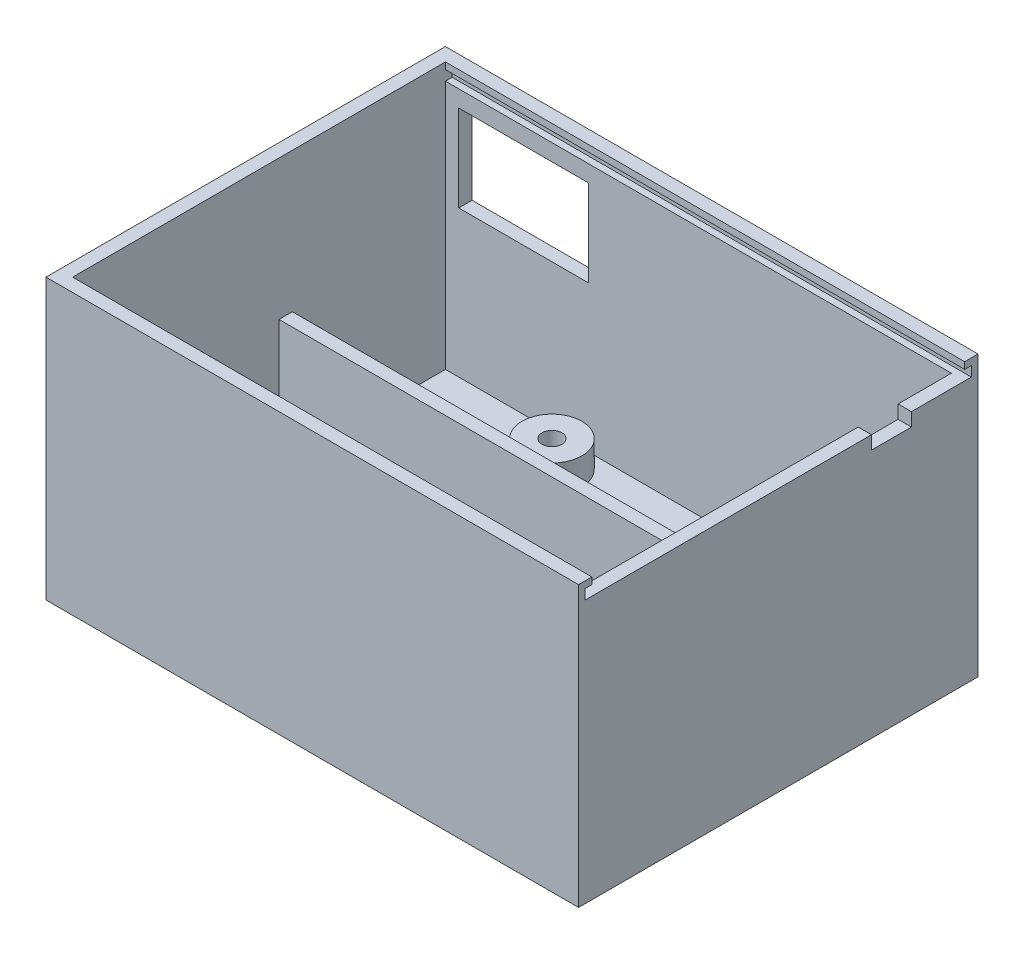
ISO-10303-21;
HEADER;
FILE_DESCRIPTION(('STEP AP214'),'2;1');
FILE_NAME('part.step','',(''),(''),'','','');
FILE_SCHEMA(('AUTOMOTIVE_DESIGN { 1 0 10303 214 1 1 1 1 }'));
ENDSEC;
DATA;
#1=APPLICATION_CONTEXT('core data for automotive mechanical design processes');
#2=APPLICATION_PROTOCOL_DEFINITION('international standard','automotive_design',2000,#1);
#3=PRODUCT_CONTEXT('',#1,'mechanical');
#4=PRODUCT('Part','Part','',(#3));
#5=PRODUCT_RELATED_PRODUCT_CATEGORY('part','',(#4));
#6=PRODUCT_DEFINITION_FORMATION('','',#4);
#7=PRODUCT_DEFINITION_CONTEXT('part definition',#1,'design');
#8=PRODUCT_DEFINITION('design','',#6,#7);
#9=PRODUCT_DEFINITION_SHAPE('','',#8);
#10=(LENGTH_UNIT() NAMED_UNIT(*) SI_UNIT(.MILLI.,.METRE.));
#11=(NAMED_UNIT(*) PLANE_ANGLE_UNIT() SI_UNIT($,.RADIAN.));
#12=(NAMED_UNIT(*) SI_UNIT($,.STERADIAN.) SOLID_ANGLE_UNIT());
#13=UNCERTAINTY_MEASURE_WITH_UNIT(LENGTH_MEASURE(1.E-05),#10,'distance_accuracy_value','');
#14=(GEOMETRIC_REPRESENTATION_CONTEXT(3) GLOBAL_UNCERTAINTY_ASSIGNED_CONTEXT((#13)) GLOBAL_UNIT_ASSIGNED_CONTEXT((#10,
#11,#12)) REPRESENTATION_CONTEXT('',''));
#15=CARTESIAN_POINT('',(0.,0.,0.));
#16=DIRECTION('',(0.,0.,1.));
#17=DIRECTION('',(1.,0.,0.));
#18=AXIS2_PLACEMENT_3D('',#15,#16,#17);
#19=CARTESIAN_POINT('',(-56.0193933094788,39.5,-1.));
#20=DIRECTION('',(0.,-1.,0.));
#21=DIRECTION('',(0.,0.,-1.));
#22=AXIS2_PLACEMENT_3D('',#19,#20,#21);
#23=PLANE('',#22);
#24=DIRECTION('',(0.,0.,-1.));
#25=VECTOR('',#24,1.);
#26=CARTESIAN_POINT('',(80.,39.5,-1.));
#27=LINE('',#26,#25);
#28=CARTESIAN_POINT('',(80.,39.5,-1.));
#29=VERTEX_POINT('',#28);
#30=CARTESIAN_POINT('',(80.,39.5,-44.));
#31=VERTEX_POINT('',#30);
#32=EDGE_CURVE('E293',#29,#31,#27,.T.);
#33=ORIENTED_EDGE('',*,*,#32,.T.);
#34=DIRECTION('',(1.,0.,0.));
#35=VECTOR('',#34,1.);
#36=CARTESIAN_POINT('',(-0.001000000000001,39.5,-44.));
#37=LINE('',#36,#35);
#38=CARTESIAN_POINT('',(78.,39.5,-44.));
#39=VERTEX_POINT('',#38);
#40=EDGE_CURVE('E275',#39,#31,#37,.T.);
#41=ORIENTED_EDGE('',*,*,#40,.F.);
#42=DIRECTION('',(0.,0.,1.));
#43=VECTOR('',#42,1.);
#44=CARTESIAN_POINT('',(78.,39.5,0.));
#45=LINE('',#44,#43);
#46=CARTESIAN_POINT('',(78.,39.5,-2.));
#47=VERTEX_POINT('',#46);
#48=EDGE_CURVE('E313',#39,#47,#45,.T.);
#49=ORIENTED_EDGE('',*,*,#48,.T.);
#50=DIRECTION('',(-1.,0.,0.));
#51=VECTOR('',#50,1.);
#52=CARTESIAN_POINT('',(0.,39.5,-2.));
#53=LINE('',#52,#51);
#54=CARTESIAN_POINT('',(2.,39.5,-2.));
#55=VERTEX_POINT('',#54);
#56=EDGE_CURVE('E317',#47,#55,#53,.T.);
#57=ORIENTED_EDGE('',*,*,#56,.T.);
#58=DIRECTION('',(0.,0.,1.));
#59=VECTOR('',#58,1.);
#60=CARTESIAN_POINT('',(2.,39.5,-1.));
#61=LINE('',#60,#59);
#62=CARTESIAN_POINT('',(2.,39.5,-1.));
#63=VERTEX_POINT('',#62);
#64=EDGE_CURVE('E289',#55,#63,#61,.T.);
#65=ORIENTED_EDGE('',*,*,#64,.T.);
#66=DIRECTION('',(1.,0.,0.));
#67=VECTOR('',#66,1.);
#68=CARTESIAN_POINT('',(-56.0193933094788,39.5,-1.));
#69=LINE('',#68,#67);
#70=EDGE_CURVE('E302',#63,#29,#69,.T.);
#71=ORIENTED_EDGE('',*,*,#70,.T.);
#72=EDGE_LOOP('',(#33,#41,#49,#57,#65,#71));
#73=FACE_BOUND('',#72,.T.);
#74=ADVANCED_FACE('F33',(#73),#23,.F.);
#75=CARTESIAN_POINT('',(0.,42.,-2.));
#76=DIRECTION('',(0.,0.,-1.));
#77=DIRECTION('',(-1.,0.,0.));
#78=AXIS2_PLACEMENT_3D('',#75,#76,#77);
#79=PLANE('',#78);
#80=DIRECTION('',(1.,0.,0.));
#81=VECTOR('',#80,1.);
#82=CARTESIAN_POINT('',(0.,41.,-2.));
#83=LINE('',#82,#81);
#84=CARTESIAN_POINT('',(2.,41.,-2.));
#85=VERTEX_POINT('',#84);
#86=CARTESIAN_POINT('',(80.,41.,-2.));
#87=VERTEX_POINT('',#86);
#88=EDGE_CURVE('E319',#85,#87,#83,.T.);
#89=ORIENTED_EDGE('',*,*,#88,.F.);
#90=DIRECTION('',(0.,-1.,0.));
#91=VECTOR('',#90,1.);
#92=CARTESIAN_POINT('',(2.,42.,-2.));
#93=LINE('',#92,#91);
#94=CARTESIAN_POINT('',(2.,42.,-2.));
#95=VERTEX_POINT('',#94);
#96=EDGE_CURVE('E397',#95,#85,#93,.T.);
#97=ORIENTED_EDGE('',*,*,#96,.F.);
#98=DIRECTION('',(1.,0.,0.));
#99=VECTOR('',#98,1.);
#100=CARTESIAN_POINT('',(0.,42.,-2.));
#101=LINE('',#100,#99);
#102=CARTESIAN_POINT('',(80.,42.,-2.));
#103=VERTEX_POINT('',#102);
#104=EDGE_CURVE('E420',#95,#103,#101,.T.);
#105=ORIENTED_EDGE('',*,*,#104,.T.);
#106=DIRECTION('',(0.,-1.,0.));
#107=VECTOR('',#106,1.);
#108=CARTESIAN_POINT('',(80.,42.,-2.));
#109=LINE('',#108,#107);
#110=EDGE_CURVE('E321',#103,#87,#109,.T.);
#111=ORIENTED_EDGE('',*,*,#110,.T.);
#112=EDGE_LOOP('',(#89,#97,#105,#111));
#113=FACE_BOUND('',#112,.T.);
#114=ADVANCED_FACE('F522',(#113),#79,.T.);
#115=CARTESIAN_POINT('',(0.,42.,-58.));
#116=DIRECTION('',(0.,0.,1.));
#117=DIRECTION('',(1.,0.,0.));
#118=AXIS2_PLACEMENT_3D('',#115,#116,#117);
#119=PLANE('',#118);
#120=DIRECTION('',(-1.,0.,0.));
#121=VECTOR('',#120,1.);
#122=CARTESIAN_POINT('',(0.,41.,-58.));
#123=LINE('',#122,#121);
#124=CARTESIAN_POINT('',(80.,41.,-58.));
#125=VERTEX_POINT('',#124);
#126=CARTESIAN_POINT('',(2.,41.,-58.));
#127=VERTEX_POINT('',#126);
#128=EDGE_CURVE('E11',#125,#127,#123,.T.);
#129=ORIENTED_EDGE('',*,*,#128,.F.);
#130=DIRECTION('',(0.,1.,0.));
#131=VECTOR('',#130,1.);
#132=CARTESIAN_POINT('',(80.,42.,-58.));
#133=LINE('',#132,#131);
#134=CARTESIAN_POINT('',(80.,42.,-58.));
#135=VERTEX_POINT('',#134);
#136=EDGE_CURVE('E322',#125,#135,#133,.T.);
#137=ORIENTED_EDGE('',*,*,#136,.T.);
#138=DIRECTION('',(-1.,0.,0.));
#139=VECTOR('',#138,1.);
#140=CARTESIAN_POINT('',(0.,42.,-58.));
#141=LINE('',#140,#139);
#142=CARTESIAN_POINT('',(2.,42.,-58.));
#143=VERTEX_POINT('',#142);
#144=EDGE_CURVE('E422',#135,#143,#141,.T.);
#145=ORIENTED_EDGE('',*,*,#144,.T.);
#146=DIRECTION('',(0.,-1.,0.));
#147=VECTOR('',#146,1.);
#148=CARTESIAN_POINT('',(2.,42.,-58.));
#149=LINE('',#148,#147);
#150=EDGE_CURVE('E402',#143,#127,#149,.T.);
#151=ORIENTED_EDGE('',*,*,#150,.T.);
#152=EDGE_LOOP('',(#129,#137,#145,#151));
#153=FACE_BOUND('',#152,.T.);
#154=ADVANCED_FACE('F529',(#153),#119,.T.);
#155=CARTESIAN_POINT('',(0.,2.,0.));
#156=DIRECTION('',(0.,-1.,0.));
#157=DIRECTION('',(0.,0.,-1.));
#158=AXIS2_PLACEMENT_3D('',#155,#156,#157);
#159=PLANE('',#158);
#160=DIRECTION('',(-1.,0.,0.));
#161=VECTOR('',#160,1.);
#162=CARTESIAN_POINT('',(78.,2.,-19.));
#163=LINE('',#162,#161);
#164=CARTESIAN_POINT('',(78.,2.,-19.));
#165=VERTEX_POINT('',#164);
#166=CARTESIAN_POINT('',(18.,2.,-19.));
#167=VERTEX_POINT('',#166);
#168=EDGE_CURVE('E362',#165,#167,#163,.T.);
#169=ORIENTED_EDGE('',*,*,#168,.F.);
#170=DIRECTION('',(0.,0.,-1.));
#171=VECTOR('',#170,1.);
#172=CARTESIAN_POINT('',(78.,2.,0.));
#173=LINE('',#172,#171);
#174=CARTESIAN_POINT('',(78.,2.,-58.));
#175=VERTEX_POINT('',#174);
#176=EDGE_CURVE('E409',#165,#175,#173,.T.);
#177=ORIENTED_EDGE('',*,*,#176,.T.);
#178=DIRECTION('',(-1.,0.,0.));
#179=VECTOR('',#178,1.);
#180=CARTESIAN_POINT('',(0.,2.,-58.));
#181=LINE('',#180,#179);
#182=CARTESIAN_POINT('',(2.,2.,-58.));
#183=VERTEX_POINT('',#182);
#184=EDGE_CURVE('E414',#175,#183,#181,.T.);
#185=ORIENTED_EDGE('',*,*,#184,.T.);
#186=DIRECTION('',(0.,0.,1.));
#187=VECTOR('',#186,1.);
#188=CARTESIAN_POINT('',(2.,2.,0.));
#189=LINE('',#188,#187);
#190=CARTESIAN_POINT('',(2.,2.,-2.));
#191=VERTEX_POINT('',#190);
#192=EDGE_CURVE('E393',#183,#191,#189,.T.);
#193=ORIENTED_EDGE('',*,*,#192,.T.);
#194=DIRECTION('',(1.,0.,0.));
#195=VECTOR('',#194,1.);
#196=CARTESIAN_POINT('',(0.,2.,-2.));
#197=LINE('',#196,#195);
#198=CARTESIAN_POINT('',(78.,2.,-2.));
#199=VERTEX_POINT('',#198);
#200=EDGE_CURVE('E396',#191,#199,#197,.T.);
#201=ORIENTED_EDGE('',*,*,#200,.T.);
#202=CARTESIAN_POINT('',(78.,2.,-17.));
#203=VERTEX_POINT('',#202);
#204=EDGE_CURVE('E412',#199,#203,#173,.T.);
#205=ORIENTED_EDGE('',*,*,#204,.T.);
#206=DIRECTION('',(1.,0.,0.));
#207=VECTOR('',#206,1.);
#208=CARTESIAN_POINT('',(78.,2.,-17.));
#209=LINE('',#208,#207);
#210=CARTESIAN_POINT('',(18.,2.,-17.));
#211=VERTEX_POINT('',#210);
#212=EDGE_CURVE('E367',#211,#203,#209,.T.);
#213=ORIENTED_EDGE('',*,*,#212,.F.);
#214=DIRECTION('',(0.,0.,1.));
#215=VECTOR('',#214,1.);
#216=CARTESIAN_POINT('',(18.,2.,-17.));
#217=LINE('',#216,#215);
#218=EDGE_CURVE('E377',#167,#211,#217,.T.);
#219=ORIENTED_EDGE('',*,*,#218,.F.);
#220=EDGE_LOOP('',(#169,#177,#185,#193,#201,#205,#213,#219));
#221=FACE_BOUND('',#220,.T.);
#222=CARTESIAN_POINT('',(7.,2.,-24.));
#223=DIRECTION('',(0.,-1.,0.));
#224=DIRECTION('',(0.,0.,-1.));
#225=AXIS2_PLACEMENT_3D('',#222,#223,#224);
#226=CIRCLE('',#225,4.5);
#227=CARTESIAN_POINT('',(7.,2.,-28.5));
#228=VERTEX_POINT('',#227);
#229=EDGE_CURVE('E455',#228,#228,#226,.F.);
#230=ORIENTED_EDGE('',*,*,#229,.F.);
#231=EDGE_LOOP('',(#230));
#232=FACE_BOUND('',#231,.T.);
#233=CARTESIAN_POINT('',(23.,2.,-53.));
#234=DIRECTION('',(0.,-1.,0.));
#235=DIRECTION('',(0.,0.,-1.));
#236=AXIS2_PLACEMENT_3D('',#233,#234,#235);
#237=CIRCLE('',#236,4.50000000000001);
#238=CARTESIAN_POINT('',(23.,2.,-57.5));
#239=VERTEX_POINT('',#238);
#240=EDGE_CURVE('E458',#239,#239,#237,.F.);
#241=ORIENTED_EDGE('',*,*,#240,.F.);
#242=EDGE_LOOP('',(#241));
#243=FACE_BOUND('',#242,.T.);
#244=CARTESIAN_POINT('',(49.,2.,-25.));
#245=DIRECTION('',(0.,-1.,0.));
#246=DIRECTION('',(0.,0.,-1.));
#247=AXIS2_PLACEMENT_3D('',#244,#245,#246);
#248=CIRCLE('',#247,4.5);
#249=CARTESIAN_POINT('',(49.,2.,-29.5));
#250=VERTEX_POINT('',#249);
#251=EDGE_CURVE('E461',#250,#250,#248,.F.);
#252=ORIENTED_EDGE('',*,*,#251,.F.);
#253=EDGE_LOOP('',(#252));
#254=FACE_BOUND('',#253,.T.);
#255=CARTESIAN_POINT('',(72.,2.,-48.));
#256=DIRECTION('',(0.,-1.,0.));
#257=DIRECTION('',(0.,0.,-1.));
#258=AXIS2_PLACEMENT_3D('',#255,#256,#257);
#259=CIRCLE('',#258,4.50000000000001);
#260=CARTESIAN_POINT('',(72.,2.,-52.5));
#261=VERTEX_POINT('',#260);
#262=EDGE_CURVE('E464',#261,#261,#259,.F.);
#263=ORIENTED_EDGE('',*,*,#262,.F.);
#264=EDGE_LOOP('',(#263));
#265=FACE_BOUND('',#264,.T.);
#266=ADVANCED_FACE('F481',(#221,#232,#243,#254,#265),#159,.F.);
#267=CARTESIAN_POINT('',(78.,42.,0.));
#268=DIRECTION('',(-1.,0.,0.));
#269=DIRECTION('',(0.,0.,1.));
#270=AXIS2_PLACEMENT_3D('',#267,#268,#269);
#271=PLANE('',#270);
#272=DIRECTION('',(0.,-1.,0.));
#273=VECTOR('',#272,1.);
#274=CARTESIAN_POINT('',(78.,39.5,-44.));
#275=LINE('',#274,#273);
#276=CARTESIAN_POINT('',(78.,37.5,-44.));
#277=VERTEX_POINT('',#276);
#278=EDGE_CURVE('E254',#39,#277,#275,.T.);
#279=ORIENTED_EDGE('',*,*,#278,.T.);
#280=DIRECTION('',(0.,0.,-1.));
#281=VECTOR('',#280,1.);
#282=CARTESIAN_POINT('',(78.,37.5,-44.));
#283=LINE('',#282,#281);
#284=CARTESIAN_POINT('',(78.,37.5,-50.));
#285=VERTEX_POINT('',#284);
#286=EDGE_CURVE('E255',#277,#285,#283,.T.);
#287=ORIENTED_EDGE('',*,*,#286,.T.);
#288=DIRECTION('',(0.,1.,0.));
#289=VECTOR('',#288,1.);
#290=CARTESIAN_POINT('',(78.,39.5,-50.));
#291=LINE('',#290,#289);
#292=CARTESIAN_POINT('',(78.,39.5,-50.));
#293=VERTEX_POINT('',#292);
#294=EDGE_CURVE('E272',#285,#293,#291,.T.);
#295=ORIENTED_EDGE('',*,*,#294,.T.);
#296=CARTESIAN_POINT('',(78.,39.5,-58.));
#297=VERTEX_POINT('',#296);
#298=EDGE_CURVE('E314',#297,#293,#45,.T.);
#299=ORIENTED_EDGE('',*,*,#298,.F.);
#300=DIRECTION('',(0.,-1.,0.));
#301=VECTOR('',#300,1.);
#302=CARTESIAN_POINT('',(78.,42.,-58.));
#303=LINE('',#302,#301);
#304=EDGE_CURVE('E405',#297,#175,#303,.T.);
#305=ORIENTED_EDGE('',*,*,#304,.T.);
#306=ORIENTED_EDGE('',*,*,#176,.F.);
#307=DIRECTION('',(0.,-1.,0.));
#308=VECTOR('',#307,1.);
#309=CARTESIAN_POINT('',(78.,37.,-19.));
#310=LINE('',#309,#308);
#311=CARTESIAN_POINT('',(78.,37.,-19.));
#312=VERTEX_POINT('',#311);
#313=EDGE_CURVE('E390',#312,#165,#310,.T.);
#314=ORIENTED_EDGE('',*,*,#313,.F.);
#315=DIRECTION('',(0.,0.,-1.));
#316=VECTOR('',#315,1.);
#317=CARTESIAN_POINT('',(78.,37.,-17.));
#318=LINE('',#317,#316);
#319=CARTESIAN_POINT('',(78.,37.,-17.));
#320=VERTEX_POINT('',#319);
#321=EDGE_CURVE('E363',#320,#312,#318,.T.);
#322=ORIENTED_EDGE('',*,*,#321,.F.);
#323=DIRECTION('',(0.,-1.,0.));
#324=VECTOR('',#323,1.);
#325=CARTESIAN_POINT('',(78.,37.,-17.));
#326=LINE('',#325,#324);
#327=EDGE_CURVE('E374',#320,#203,#326,.T.);
#328=ORIENTED_EDGE('',*,*,#327,.T.);
#329=ORIENTED_EDGE('',*,*,#204,.F.);
#330=DIRECTION('',(0.,-1.,0.));
#331=VECTOR('',#330,1.);
#332=CARTESIAN_POINT('',(78.,42.,-2.));
#333=LINE('',#332,#331);
#334=EDGE_CURVE('E410',#47,#199,#333,.T.);
#335=ORIENTED_EDGE('',*,*,#334,.F.);
#336=ORIENTED_EDGE('',*,*,#48,.F.);
#337=EDGE_LOOP('',(#279,#287,#295,#299,#305,#306,#314,#322,#328,#329,#335,#336));
#338=FACE_BOUND('',#337,.T.);
#339=ADVANCED_FACE('F475',(#338),#271,.T.);
#340=CARTESIAN_POINT('',(0.,42.,0.));
#341=DIRECTION('',(0.,-1.,0.));
#342=DIRECTION('',(0.,0.,-1.));
#343=AXIS2_PLACEMENT_3D('',#340,#341,#342);
#344=PLANE('',#343);
#345=DIRECTION('',(0.,0.,-1.));
#346=VECTOR('',#345,1.);
#347=CARTESIAN_POINT('',(80.,42.,0.));
#348=LINE('',#347,#346);
#349=CARTESIAN_POINT('',(80.,42.,0.));
#350=VERTEX_POINT('',#349);
#351=EDGE_CURVE('E431',#350,#103,#348,.T.);
#352=ORIENTED_EDGE('',*,*,#351,.T.);
#353=ORIENTED_EDGE('',*,*,#104,.F.);
#354=DIRECTION('',(0.,0.,1.));
#355=VECTOR('',#354,1.);
#356=CARTESIAN_POINT('',(2.,42.,0.));
#357=LINE('',#356,#355);
#358=EDGE_CURVE('E418',#143,#95,#357,.T.);
#359=ORIENTED_EDGE('',*,*,#358,.F.);
#360=ORIENTED_EDGE('',*,*,#144,.F.);
#361=CARTESIAN_POINT('',(80.,42.,-60.));
#362=VERTEX_POINT('',#361);
#363=EDGE_CURVE('E430',#135,#362,#348,.T.);
#364=ORIENTED_EDGE('',*,*,#363,.T.);
#365=DIRECTION('',(-1.,0.,0.));
#366=VECTOR('',#365,1.);
#367=CARTESIAN_POINT('',(0.,42.,-60.));
#368=LINE('',#367,#366);
#369=CARTESIAN_POINT('',(0.,42.,-60.));
#370=VERTEX_POINT('',#369);
#371=EDGE_CURVE('E434',#362,#370,#368,.T.);
#372=ORIENTED_EDGE('',*,*,#371,.T.);
#373=DIRECTION('',(0.,0.,1.));
#374=VECTOR('',#373,1.);
#375=CARTESIAN_POINT('',(0.,42.,0.));
#376=LINE('',#375,#374);
#377=CARTESIAN_POINT('',(0.,42.,0.));
#378=VERTEX_POINT('',#377);
#379=EDGE_CURVE('E424',#370,#378,#376,.T.);
#380=ORIENTED_EDGE('',*,*,#379,.T.);
#381=DIRECTION('',(1.,0.,0.));
#382=VECTOR('',#381,1.);
#383=CARTESIAN_POINT('',(0.,42.,0.));
#384=LINE('',#383,#382);
#385=EDGE_CURVE('E427',#378,#350,#384,.T.);
#386=ORIENTED_EDGE('',*,*,#385,.T.);
#387=EDGE_LOOP('',(#352,#353,#359,#360,#364,#372,#380,#386));
#388=FACE_BOUND('',#387,.T.);
#389=ADVANCED_FACE('F672',(#388),#344,.F.);
#390=CARTESIAN_POINT('',(0.,42.,0.));
#391=DIRECTION('',(1.,0.,0.));
#392=DIRECTION('',(0.,0.,-1.));
#393=AXIS2_PLACEMENT_3D('',#390,#391,#392);
#394=PLANE('',#393);
#395=DIRECTION('',(0.,0.,1.));
#396=VECTOR('',#395,1.);
#397=CARTESIAN_POINT('',(0.,0.,0.));
#398=LINE('',#397,#396);
#399=CARTESIAN_POINT('',(0.,0.,-60.));
#400=VERTEX_POINT('',#399);
#401=CARTESIAN_POINT('',(0.,0.,0.));
#402=VERTEX_POINT('',#401);
#403=EDGE_CURVE('E400',#400,#402,#398,.T.);
#404=ORIENTED_EDGE('',*,*,#403,.T.);
#405=DIRECTION('',(0.,-1.,0.));
#406=VECTOR('',#405,1.);
#407=CARTESIAN_POINT('',(0.,42.,0.));
#408=LINE('',#407,#406);
#409=EDGE_CURVE('E452',#378,#402,#408,.T.);
#410=ORIENTED_EDGE('',*,*,#409,.F.);
#411=ORIENTED_EDGE('',*,*,#379,.F.);
#412=DIRECTION('',(0.,-1.,0.));
#413=VECTOR('',#412,1.);
#414=CARTESIAN_POINT('',(0.,42.,-60.));
#415=LINE('',#414,#413);
#416=EDGE_CURVE('E436',#370,#400,#415,.T.);
#417=ORIENTED_EDGE('',*,*,#416,.T.);
#418=EDGE_LOOP('',(#404,#410,#411,#417));
#419=FACE_BOUND('',#418,.T.);
#420=ADVANCED_FACE('F35',(#419),#394,.F.);
#421=CARTESIAN_POINT('',(0.,42.,0.));
#422=DIRECTION('',(0.,0.,-1.));
#423=DIRECTION('',(-1.,0.,0.));
#424=AXIS2_PLACEMENT_3D('',#421,#422,#423);
#425=PLANE('',#424);
#426=DIRECTION('',(1.,0.,0.));
#427=VECTOR('',#426,1.);
#428=CARTESIAN_POINT('',(0.,0.,0.));
#429=LINE('',#428,#427);
#430=CARTESIAN_POINT('',(80.,0.,0.));
#431=VERTEX_POINT('',#430);
#432=EDGE_CURVE('E439',#402,#431,#429,.T.);
#433=ORIENTED_EDGE('',*,*,#432,.T.);
#434=DIRECTION('',(0.,-1.,0.));
#435=VECTOR('',#434,1.);
#436=CARTESIAN_POINT('',(80.,42.,0.));
#437=LINE('',#436,#435);
#438=EDGE_CURVE('E449',#350,#431,#437,.T.);
#439=ORIENTED_EDGE('',*,*,#438,.F.);
#440=ORIENTED_EDGE('',*,*,#385,.F.);
#441=ORIENTED_EDGE('',*,*,#409,.T.);
#442=EDGE_LOOP('',(#433,#439,#440,#441));
#443=FACE_BOUND('',#442,.T.);
#444=ADVANCED_FACE('F903',(#443),#425,.F.);
#445=CARTESIAN_POINT('',(80.,42.,0.));
#446=DIRECTION('',(-1.,0.,0.));
#447=DIRECTION('',(0.,0.,1.));
#448=AXIS2_PLACEMENT_3D('',#445,#446,#447);
#449=PLANE('',#448);
#450=DIRECTION('',(0.,0.,-1.));
#451=VECTOR('',#450,1.);
#452=CARTESIAN_POINT('',(80.,37.5,-44.));
#453=LINE('',#452,#451);
#454=CARTESIAN_POINT('',(80.,37.5,-44.));
#455=VERTEX_POINT('',#454);
#456=CARTESIAN_POINT('',(80.,37.5,-50.));
#457=VERTEX_POINT('',#456);
#458=EDGE_CURVE('E263',#455,#457,#453,.T.);
#459=ORIENTED_EDGE('',*,*,#458,.F.);
#460=DIRECTION('',(0.,-1.,0.));
#461=VECTOR('',#460,1.);
#462=CARTESIAN_POINT('',(80.,39.5,-44.));
#463=LINE('',#462,#461);
#464=EDGE_CURVE('E266',#31,#455,#463,.T.);
#465=ORIENTED_EDGE('',*,*,#464,.F.);
#466=ORIENTED_EDGE('',*,*,#32,.F.);
#467=DIRECTION('',(0.,-1.,0.));
#468=VECTOR('',#467,1.);
#469=CARTESIAN_POINT('',(80.,39.5,-1.));
#470=LINE('',#469,#468);
#471=CARTESIAN_POINT('',(80.,41.,-1.));
#472=VERTEX_POINT('',#471);
#473=EDGE_CURVE('E262',#472,#29,#470,.T.);
#474=ORIENTED_EDGE('',*,*,#473,.F.);
#475=DIRECTION('',(0.,0.,1.));
#476=VECTOR('',#475,1.);
#477=CARTESIAN_POINT('',(80.,41.,-1.));
#478=LINE('',#477,#476);
#479=EDGE_CURVE('E299',#87,#472,#478,.T.);
#480=ORIENTED_EDGE('',*,*,#479,.F.);
#481=ORIENTED_EDGE('',*,*,#110,.F.);
#482=ORIENTED_EDGE('',*,*,#351,.F.);
#483=ORIENTED_EDGE('',*,*,#438,.T.);
#484=DIRECTION('',(0.,0.,-1.));
#485=VECTOR('',#484,1.);
#486=CARTESIAN_POINT('',(80.,0.,0.));
#487=LINE('',#486,#485);
#488=CARTESIAN_POINT('',(80.,0.,-60.));
#489=VERTEX_POINT('',#488);
#490=EDGE_CURVE('E441',#431,#489,#487,.T.);
#491=ORIENTED_EDGE('',*,*,#490,.T.);
#492=DIRECTION('',(0.,-1.,0.));
#493=VECTOR('',#492,1.);
#494=CARTESIAN_POINT('',(80.,42.,-60.));
#495=LINE('',#494,#493);
#496=EDGE_CURVE('E446',#362,#489,#495,.T.);
#497=ORIENTED_EDGE('',*,*,#496,.F.);
#498=ORIENTED_EDGE('',*,*,#363,.F.);
#499=ORIENTED_EDGE('',*,*,#136,.F.);
#500=CARTESIAN_POINT('',(80.,41.,-59.));
#501=VERTEX_POINT('',#500);
#502=EDGE_CURVE('E300',#501,#125,#478,.T.);
#503=ORIENTED_EDGE('',*,*,#502,.F.);
#504=DIRECTION('',(0.,1.,0.));
#505=VECTOR('',#504,1.);
#506=CARTESIAN_POINT('',(80.,39.5,-59.));
#507=LINE('',#506,#505);
#508=CARTESIAN_POINT('',(80.,39.5,-59.));
#509=VERTEX_POINT('',#508);
#510=EDGE_CURVE('E296',#509,#501,#507,.T.);
#511=ORIENTED_EDGE('',*,*,#510,.F.);
#512=CARTESIAN_POINT('',(80.,39.5,-50.));
#513=VERTEX_POINT('',#512);
#514=EDGE_CURVE('E292',#513,#509,#27,.T.);
#515=ORIENTED_EDGE('',*,*,#514,.F.);
#516=DIRECTION('',(0.,1.,0.));
#517=VECTOR('',#516,1.);
#518=CARTESIAN_POINT('',(80.,39.5,-50.));
#519=LINE('',#518,#517);
#520=EDGE_CURVE('E260',#457,#513,#519,.T.);
#521=ORIENTED_EDGE('',*,*,#520,.F.);
#522=EDGE_LOOP('',(#459,#465,#466,#474,#480,#481,#482,#483,#491,#497,#498,#499,#503,#511,#515,#521));
#523=FACE_BOUND('',#522,.T.);
#524=ADVANCED_FACE('F701',(#523),#449,.F.);
#525=CARTESIAN_POINT('',(0.,42.,-60.));
#526=DIRECTION('',(0.,0.,1.));
#527=DIRECTION('',(1.,0.,0.));
#528=AXIS2_PLACEMENT_3D('',#525,#526,#527);
#529=PLANE('',#528);
#530=DIRECTION('',(0.,1.,0.));
#531=VECTOR('',#530,1.);
#532=CARTESIAN_POINT('',(4.,37.,-60.));
#533=LINE('',#532,#531);
#534=CARTESIAN_POINT('',(4.,24.,-60.));
#535=VERTEX_POINT('',#534);
#536=CARTESIAN_POINT('',(4.,37.,-60.));
#537=VERTEX_POINT('',#536);
#538=EDGE_CURVE('E233',#535,#537,#533,.T.);
#539=ORIENTED_EDGE('',*,*,#538,.F.);
#540=DIRECTION('',(-1.,0.,0.));
#541=VECTOR('',#540,1.);
#542=CARTESIAN_POINT('',(23.5,24.,-60.));
#543=LINE('',#542,#541);
#544=CARTESIAN_POINT('',(23.5,24.,-60.));
#545=VERTEX_POINT('',#544);
#546=EDGE_CURVE('E245',#545,#535,#543,.T.);
#547=ORIENTED_EDGE('',*,*,#546,.F.);
#548=DIRECTION('',(0.,-1.,0.));
#549=VECTOR('',#548,1.);
#550=CARTESIAN_POINT('',(23.5,37.,-60.));
#551=LINE('',#550,#549);
#552=CARTESIAN_POINT('',(23.5,37.,-60.));
#553=VERTEX_POINT('',#552);
#554=EDGE_CURVE('E243',#553,#545,#551,.T.);
#555=ORIENTED_EDGE('',*,*,#554,.F.);
#556=DIRECTION('',(1.,0.,0.));
#557=VECTOR('',#556,1.);
#558=CARTESIAN_POINT('',(23.5,37.,-60.));
#559=LINE('',#558,#557);
#560=EDGE_CURVE('E48',#537,#553,#559,.T.);
#561=ORIENTED_EDGE('',*,*,#560,.F.);
#562=EDGE_LOOP('',(#539,#547,#555,#561));
#563=FACE_BOUND('',#562,.T.);
#564=DIRECTION('',(-1.,0.,0.));
#565=VECTOR('',#564,1.);
#566=CARTESIAN_POINT('',(0.,0.,-60.));
#567=LINE('',#566,#565);
#568=EDGE_CURVE('E428',#489,#400,#567,.T.);
#569=ORIENTED_EDGE('',*,*,#568,.T.);
#570=ORIENTED_EDGE('',*,*,#416,.F.);
#571=ORIENTED_EDGE('',*,*,#371,.F.);
#572=ORIENTED_EDGE('',*,*,#496,.T.);
#573=EDGE_LOOP('',(#569,#570,#571,#572));
#574=FACE_BOUND('',#573,.T.);
#575=ADVANCED_FACE('F698',(#563,#574),#529,.F.);
#576=CARTESIAN_POINT('',(0.,0.,0.));
#577=DIRECTION('',(0.,-1.,0.));
#578=DIRECTION('',(0.,0.,-1.));
#579=AXIS2_PLACEMENT_3D('',#576,#577,#578);
#580=PLANE('',#579);
#581=ORIENTED_EDGE('',*,*,#403,.F.);
#582=ORIENTED_EDGE('',*,*,#568,.F.);
#583=ORIENTED_EDGE('',*,*,#490,.F.);
#584=ORIENTED_EDGE('',*,*,#432,.F.);
#585=EDGE_LOOP('',(#581,#582,#583,#584));
#586=FACE_BOUND('',#585,.T.);
#587=ADVANCED_FACE('F653',(#586),#580,.T.);
#588=CARTESIAN_POINT('',(2.,42.,0.));
#589=DIRECTION('',(1.,0.,0.));
#590=DIRECTION('',(0.,0.,-1.));
#591=AXIS2_PLACEMENT_3D('',#588,#589,#590);
#592=PLANE('',#591);
#593=CARTESIAN_POINT('',(2.,39.5,-58.));
#594=VERTEX_POINT('',#593);
#595=EDGE_CURVE('E406',#594,#183,#149,.T.);
#596=ORIENTED_EDGE('',*,*,#595,.F.);
#597=CARTESIAN_POINT('',(2.,39.5,-59.));
#598=VERTEX_POINT('',#597);
#599=EDGE_CURVE('E311',#598,#594,#61,.T.);
#600=ORIENTED_EDGE('',*,*,#599,.F.);
#601=DIRECTION('',(0.,-1.,0.));
#602=VECTOR('',#601,1.);
#603=CARTESIAN_POINT('',(2.,39.5,-59.));
#604=LINE('',#603,#602);
#605=CARTESIAN_POINT('',(2.,41.,-59.));
#606=VERTEX_POINT('',#605);
#607=EDGE_CURVE('E281',#606,#598,#604,.T.);
#608=ORIENTED_EDGE('',*,*,#607,.F.);
#609=DIRECTION('',(0.,0.,-1.));
#610=VECTOR('',#609,1.);
#611=CARTESIAN_POINT('',(2.,41.,-1.));
#612=LINE('',#611,#610);
#613=EDGE_CURVE('E283',#127,#606,#612,.T.);
#614=ORIENTED_EDGE('',*,*,#613,.F.);
#615=ORIENTED_EDGE('',*,*,#150,.F.);
#616=ORIENTED_EDGE('',*,*,#358,.T.);
#617=ORIENTED_EDGE('',*,*,#96,.T.);
#618=CARTESIAN_POINT('',(2.,41.,-1.));
#619=VERTEX_POINT('',#618);
#620=EDGE_CURVE('E285',#619,#85,#612,.T.);
#621=ORIENTED_EDGE('',*,*,#620,.F.);
#622=DIRECTION('',(0.,1.,0.));
#623=VECTOR('',#622,1.);
#624=CARTESIAN_POINT('',(2.,39.5,-1.));
#625=LINE('',#624,#623);
#626=EDGE_CURVE('E287',#63,#619,#625,.T.);
#627=ORIENTED_EDGE('',*,*,#626,.F.);
#628=ORIENTED_EDGE('',*,*,#64,.F.);
#629=EDGE_CURVE('E401',#55,#191,#93,.T.);
#630=ORIENTED_EDGE('',*,*,#629,.T.);
#631=ORIENTED_EDGE('',*,*,#192,.F.);
#632=EDGE_LOOP('',(#596,#600,#608,#614,#615,#616,#617,#621,#627,#628,#630,#631));
#633=FACE_BOUND('',#632,.T.);
#634=ADVANCED_FACE('F484',(#633),#592,.T.);
#635=ORIENTED_EDGE('',*,*,#56,.F.);
#636=ORIENTED_EDGE('',*,*,#334,.T.);
#637=ORIENTED_EDGE('',*,*,#200,.F.);
#638=ORIENTED_EDGE('',*,*,#629,.F.);
#639=EDGE_LOOP('',(#635,#636,#637,#638));
#640=FACE_BOUND('',#639,.T.);
#641=ADVANCED_FACE('F491',(#640),#79,.T.);
#642=DIRECTION('',(-1.,0.,0.));
#643=VECTOR('',#642,1.);
#644=CARTESIAN_POINT('',(23.5,24.,-58.));
#645=LINE('',#644,#643);
#646=CARTESIAN_POINT('',(23.5,24.,-58.));
#647=VERTEX_POINT('',#646);
#648=CARTESIAN_POINT('',(4.,24.,-58.));
#649=VERTEX_POINT('',#648);
#650=EDGE_CURVE('E239',#647,#649,#645,.T.);
#651=ORIENTED_EDGE('',*,*,#650,.T.);
#652=DIRECTION('',(0.,1.,0.));
#653=VECTOR('',#652,1.);
#654=CARTESIAN_POINT('',(4.,37.,-58.));
#655=LINE('',#654,#653);
#656=CARTESIAN_POINT('',(4.,37.,-58.));
#657=VERTEX_POINT('',#656);
#658=EDGE_CURVE('E227',#649,#657,#655,.T.);
#659=ORIENTED_EDGE('',*,*,#658,.T.);
#660=DIRECTION('',(1.,0.,0.));
#661=VECTOR('',#660,1.);
#662=CARTESIAN_POINT('',(23.5,37.,-58.));
#663=LINE('',#662,#661);
#664=CARTESIAN_POINT('',(23.5,37.,-58.));
#665=VERTEX_POINT('',#664);
#666=EDGE_CURVE('E217',#657,#665,#663,.T.);
#667=ORIENTED_EDGE('',*,*,#666,.T.);
#668=DIRECTION('',(0.,-1.,0.));
#669=VECTOR('',#668,1.);
#670=CARTESIAN_POINT('',(23.5,37.,-58.));
#671=LINE('',#670,#669);
#672=EDGE_CURVE('E226',#665,#647,#671,.T.);
#673=ORIENTED_EDGE('',*,*,#672,.T.);
#674=EDGE_LOOP('',(#651,#659,#667,#673));
#675=FACE_BOUND('',#674,.T.);
#676=DIRECTION('',(1.,0.,0.));
#677=VECTOR('',#676,1.);
#678=CARTESIAN_POINT('',(0.,39.5,-58.));
#679=LINE('',#678,#677);
#680=EDGE_CURVE('E41',#594,#297,#679,.T.);
#681=ORIENTED_EDGE('',*,*,#680,.F.);
#682=ORIENTED_EDGE('',*,*,#595,.T.);
#683=ORIENTED_EDGE('',*,*,#184,.F.);
#684=ORIENTED_EDGE('',*,*,#304,.F.);
#685=EDGE_LOOP('',(#681,#682,#683,#684));
#686=FACE_BOUND('',#685,.T.);
#687=ADVANCED_FACE('F237',(#675,#686),#119,.T.);
#688=CARTESIAN_POINT('',(78.,37.,-19.));
#689=DIRECTION('',(0.,0.,1.));
#690=DIRECTION('',(1.,0.,0.));
#691=AXIS2_PLACEMENT_3D('',#688,#689,#690);
#692=PLANE('',#691);
#693=ORIENTED_EDGE('',*,*,#168,.T.);
#694=DIRECTION('',(0.,-1.,0.));
#695=VECTOR('',#694,1.);
#696=CARTESIAN_POINT('',(18.,37.,-19.));
#697=LINE('',#696,#695);
#698=CARTESIAN_POINT('',(18.,37.,-19.));
#699=VERTEX_POINT('',#698);
#700=EDGE_CURVE('E387',#699,#167,#697,.T.);
#701=ORIENTED_EDGE('',*,*,#700,.F.);
#702=DIRECTION('',(-1.,0.,0.));
#703=VECTOR('',#702,1.);
#704=CARTESIAN_POINT('',(78.,37.,-19.));
#705=LINE('',#704,#703);
#706=EDGE_CURVE('E366',#312,#699,#705,.T.);
#707=ORIENTED_EDGE('',*,*,#706,.F.);
#708=ORIENTED_EDGE('',*,*,#313,.T.);
#709=EDGE_LOOP('',(#693,#701,#707,#708));
#710=FACE_BOUND('',#709,.T.);
#711=ADVANCED_FACE('F506',(#710),#692,.F.);
#712=CARTESIAN_POINT('',(18.,37.,-17.));
#713=DIRECTION('',(1.,0.,0.));
#714=DIRECTION('',(0.,0.,-1.));
#715=AXIS2_PLACEMENT_3D('',#712,#713,#714);
#716=PLANE('',#715);
#717=ORIENTED_EDGE('',*,*,#218,.T.);
#718=DIRECTION('',(0.,-1.,0.));
#719=VECTOR('',#718,1.);
#720=CARTESIAN_POINT('',(18.,37.,-17.));
#721=LINE('',#720,#719);
#722=CARTESIAN_POINT('',(18.,37.,-17.));
#723=VERTEX_POINT('',#722);
#724=EDGE_CURVE('E384',#723,#211,#721,.T.);
#725=ORIENTED_EDGE('',*,*,#724,.F.);
#726=DIRECTION('',(0.,0.,1.));
#727=VECTOR('',#726,1.);
#728=CARTESIAN_POINT('',(18.,37.,-17.));
#729=LINE('',#728,#727);
#730=EDGE_CURVE('E369',#699,#723,#729,.T.);
#731=ORIENTED_EDGE('',*,*,#730,.F.);
#732=ORIENTED_EDGE('',*,*,#700,.T.);
#733=EDGE_LOOP('',(#717,#725,#731,#732));
#734=FACE_BOUND('',#733,.T.);
#735=ADVANCED_FACE('F501',(#734),#716,.F.);
#736=CARTESIAN_POINT('',(78.,37.,-17.));
#737=DIRECTION('',(0.,0.,-1.));
#738=DIRECTION('',(-1.,0.,0.));
#739=AXIS2_PLACEMENT_3D('',#736,#737,#738);
#740=PLANE('',#739);
#741=ORIENTED_EDGE('',*,*,#212,.T.);
#742=ORIENTED_EDGE('',*,*,#327,.F.);
#743=DIRECTION('',(1.,0.,0.));
#744=VECTOR('',#743,1.);
#745=CARTESIAN_POINT('',(78.,37.,-17.));
#746=LINE('',#745,#744);
#747=EDGE_CURVE('E371',#723,#320,#746,.T.);
#748=ORIENTED_EDGE('',*,*,#747,.F.);
#749=ORIENTED_EDGE('',*,*,#724,.T.);
#750=EDGE_LOOP('',(#741,#742,#748,#749));
#751=FACE_BOUND('',#750,.T.);
#752=ADVANCED_FACE('F498',(#751),#740,.F.);
#753=CARTESIAN_POINT('',(0.,37.,0.));
#754=DIRECTION('',(0.,1.,0.));
#755=DIRECTION('',(0.,0.,1.));
#756=AXIS2_PLACEMENT_3D('',#753,#754,#755);
#757=PLANE('',#756);
#758=ORIENTED_EDGE('',*,*,#321,.T.);
#759=ORIENTED_EDGE('',*,*,#706,.T.);
#760=ORIENTED_EDGE('',*,*,#730,.T.);
#761=ORIENTED_EDGE('',*,*,#747,.T.);
#762=EDGE_LOOP('',(#758,#759,#760,#761));
#763=FACE_BOUND('',#762,.T.);
#764=ADVANCED_FACE('F508',(#763),#757,.T.);
#765=CARTESIAN_POINT('',(7.,6.,-24.));
#766=DIRECTION('',(0.,1.,0.));
#767=DIRECTION('',(0.,0.,1.));
#768=AXIS2_PLACEMENT_3D('',#765,#766,#767);
#769=PLANE('',#768);
#770=CARTESIAN_POINT('',(7.,6.,-24.));
#771=DIRECTION('',(0.,1.,0.));
#772=DIRECTION('',(0.,0.,1.));
#773=AXIS2_PLACEMENT_3D('',#770,#771,#772);
#774=CIRCLE('',#773,4.5);
#775=CARTESIAN_POINT('',(7.,6.,-19.5));
#776=VERTEX_POINT('',#775);
#777=EDGE_CURVE('E357',#776,#776,#774,.T.);
#778=ORIENTED_EDGE('',*,*,#777,.T.);
#779=EDGE_LOOP('',(#778));
#780=FACE_BOUND('',#779,.T.);
#781=CARTESIAN_POINT('',(7.,6.,-24.));
#782=DIRECTION('',(0.,1.,0.));
#783=DIRECTION('',(0.,0.,1.));
#784=AXIS2_PLACEMENT_3D('',#781,#782,#783);
#785=CIRCLE('',#784,1.5);
#786=CARTESIAN_POINT('',(7.,6.,-22.5));
#787=VERTEX_POINT('',#786);
#788=EDGE_CURVE('E354',#787,#787,#785,.T.);
#789=ORIENTED_EDGE('',*,*,#788,.F.);
#790=EDGE_LOOP('',(#789));
#791=FACE_BOUND('',#790,.T.);
#792=ADVANCED_FACE('F510',(#780,#791),#769,.T.);
#793=CARTESIAN_POINT('',(7.,6.,-24.));
#794=DIRECTION('',(0.,-1.,0.));
#795=DIRECTION('',(0.,0.,-1.));
#796=AXIS2_PLACEMENT_3D('',#793,#794,#795);
#797=CYLINDRICAL_SURFACE('',#796,4.5);
#798=ORIENTED_EDGE('',*,*,#777,.F.);
#799=EDGE_LOOP('',(#798));
#800=FACE_BOUND('',#799,.T.);
#801=ORIENTED_EDGE('',*,*,#229,.T.);
#802=EDGE_LOOP('',(#801));
#803=FACE_BOUND('',#802,.T.);
#804=ADVANCED_FACE('F516',(#800,#803),#797,.T.);
#805=CARTESIAN_POINT('',(7.,6.,-24.));
#806=DIRECTION('',(0.,-1.,0.));
#807=DIRECTION('',(0.,0.,-1.));
#808=AXIS2_PLACEMENT_3D('',#805,#806,#807);
#809=CYLINDRICAL_SURFACE('',#808,1.5);
#810=ORIENTED_EDGE('',*,*,#788,.T.);
#811=EDGE_LOOP('',(#810));
#812=FACE_BOUND('',#811,.T.);
#813=CARTESIAN_POINT('',(7.,2.,-24.));
#814=DIRECTION('',(0.,1.,0.));
#815=DIRECTION('',(0.,0.,1.));
#816=AXIS2_PLACEMENT_3D('',#813,#814,#815);
#817=CIRCLE('',#816,1.5);
#818=CARTESIAN_POINT('',(7.,2.,-22.5));
#819=VERTEX_POINT('',#818);
#820=EDGE_CURVE('E353',#819,#819,#817,.T.);
#821=ORIENTED_EDGE('',*,*,#820,.F.);
#822=EDGE_LOOP('',(#821));
#823=FACE_BOUND('',#822,.T.);
#824=ADVANCED_FACE('F755',(#812,#823),#809,.F.);
#825=ORIENTED_EDGE('',*,*,#820,.T.);
#826=EDGE_LOOP('',(#825));
#827=FACE_BOUND('',#826,.T.);
#828=ADVANCED_FACE('F764',(#827),#159,.F.);
#829=CARTESIAN_POINT('',(23.,6.,-53.));
#830=DIRECTION('',(0.,1.,0.));
#831=DIRECTION('',(0.,0.,1.));
#832=AXIS2_PLACEMENT_3D('',#829,#830,#831);
#833=PLANE('',#832);
#834=CARTESIAN_POINT('',(23.,6.,-53.));
#835=DIRECTION('',(0.,1.,0.));
#836=DIRECTION('',(0.,0.,1.));
#837=AXIS2_PLACEMENT_3D('',#834,#835,#836);
#838=CIRCLE('',#837,4.50000000000001);
#839=CARTESIAN_POINT('',(23.,6.,-48.5));
#840=VERTEX_POINT('',#839);
#841=EDGE_CURVE('E348',#840,#840,#838,.T.);
#842=ORIENTED_EDGE('',*,*,#841,.T.);
#843=EDGE_LOOP('',(#842));
#844=FACE_BOUND('',#843,.T.);
#845=CARTESIAN_POINT('',(23.,6.,-53.));
#846=DIRECTION('',(0.,1.,0.));
#847=DIRECTION('',(0.,0.,1.));
#848=AXIS2_PLACEMENT_3D('',#845,#846,#847);
#849=CIRCLE('',#848,1.5);
#850=CARTESIAN_POINT('',(23.,6.,-51.5));
#851=VERTEX_POINT('',#850);
#852=EDGE_CURVE('E345',#851,#851,#849,.T.);
#853=ORIENTED_EDGE('',*,*,#852,.F.);
#854=EDGE_LOOP('',(#853));
#855=FACE_BOUND('',#854,.T.);
#856=ADVANCED_FACE('F775',(#844,#855),#833,.T.);
#857=CARTESIAN_POINT('',(23.,6.,-53.));
#858=DIRECTION('',(0.,-1.,0.));
#859=DIRECTION('',(0.,0.,-1.));
#860=AXIS2_PLACEMENT_3D('',#857,#858,#859);
#861=CYLINDRICAL_SURFACE('',#860,4.50000000000001);
#862=ORIENTED_EDGE('',*,*,#841,.F.);
#863=EDGE_LOOP('',(#862));
#864=FACE_BOUND('',#863,.T.);
#865=ORIENTED_EDGE('',*,*,#240,.T.);
#866=EDGE_LOOP('',(#865));
#867=FACE_BOUND('',#866,.T.);
#868=ADVANCED_FACE('F786',(#864,#867),#861,.T.);
#869=CARTESIAN_POINT('',(23.,6.,-53.));
#870=DIRECTION('',(0.,-1.,0.));
#871=DIRECTION('',(0.,0.,-1.));
#872=AXIS2_PLACEMENT_3D('',#869,#870,#871);
#873=CYLINDRICAL_SURFACE('',#872,1.5);
#874=ORIENTED_EDGE('',*,*,#852,.T.);
#875=EDGE_LOOP('',(#874));
#876=FACE_BOUND('',#875,.T.);
#877=CARTESIAN_POINT('',(23.,2.,-53.));
#878=DIRECTION('',(0.,1.,0.));
#879=DIRECTION('',(0.,0.,1.));
#880=AXIS2_PLACEMENT_3D('',#877,#878,#879);
#881=CIRCLE('',#880,1.5);
#882=CARTESIAN_POINT('',(23.,2.,-51.5));
#883=VERTEX_POINT('',#882);
#884=EDGE_CURVE('E344',#883,#883,#881,.T.);
#885=ORIENTED_EDGE('',*,*,#884,.F.);
#886=EDGE_LOOP('',(#885));
#887=FACE_BOUND('',#886,.T.);
#888=ADVANCED_FACE('F796',(#876,#887),#873,.F.);
#889=ORIENTED_EDGE('',*,*,#884,.T.);
#890=EDGE_LOOP('',(#889));
#891=FACE_BOUND('',#890,.T.);
#892=ADVANCED_FACE('F778',(#891),#159,.F.);
#893=CARTESIAN_POINT('',(49.,6.,-25.));
#894=DIRECTION('',(0.,1.,0.));
#895=DIRECTION('',(0.,0.,1.));
#896=AXIS2_PLACEMENT_3D('',#893,#894,#895);
#897=PLANE('',#896);
#898=CARTESIAN_POINT('',(49.,6.,-25.));
#899=DIRECTION('',(0.,1.,0.));
#900=DIRECTION('',(0.,0.,1.));
#901=AXIS2_PLACEMENT_3D('',#898,#899,#900);
#902=CIRCLE('',#901,4.5);
#903=CARTESIAN_POINT('',(49.,6.,-20.5));
#904=VERTEX_POINT('',#903);
#905=EDGE_CURVE('E339',#904,#904,#902,.T.);
#906=ORIENTED_EDGE('',*,*,#905,.T.);
#907=EDGE_LOOP('',(#906));
#908=FACE_BOUND('',#907,.T.);
#909=CARTESIAN_POINT('',(49.,6.,-25.));
#910=DIRECTION('',(0.,1.,0.));
#911=DIRECTION('',(0.,0.,1.));
#912=AXIS2_PLACEMENT_3D('',#909,#910,#911);
#913=CIRCLE('',#912,1.5);
#914=CARTESIAN_POINT('',(49.,6.,-23.5));
#915=VERTEX_POINT('',#914);
#916=EDGE_CURVE('E336',#915,#915,#913,.T.);
#917=ORIENTED_EDGE('',*,*,#916,.F.);
#918=EDGE_LOOP('',(#917));
#919=FACE_BOUND('',#918,.T.);
#920=ADVANCED_FACE('F815',(#908,#919),#897,.T.);
#921=CARTESIAN_POINT('',(49.,6.,-25.));
#922=DIRECTION('',(0.,-1.,0.));
#923=DIRECTION('',(0.,0.,-1.));
#924=AXIS2_PLACEMENT_3D('',#921,#922,#923);
#925=CYLINDRICAL_SURFACE('',#924,4.5);
#926=ORIENTED_EDGE('',*,*,#905,.F.);
#927=EDGE_LOOP('',(#926));
#928=FACE_BOUND('',#927,.T.);
#929=ORIENTED_EDGE('',*,*,#251,.T.);
#930=EDGE_LOOP('',(#929));
#931=FACE_BOUND('',#930,.T.);
#932=ADVANCED_FACE('F833',(#928,#931),#925,.T.);
#933=CARTESIAN_POINT('',(49.,6.,-25.));
#934=DIRECTION('',(0.,-1.,0.));
#935=DIRECTION('',(0.,0.,-1.));
#936=AXIS2_PLACEMENT_3D('',#933,#934,#935);
#937=CYLINDRICAL_SURFACE('',#936,1.5);
#938=ORIENTED_EDGE('',*,*,#916,.T.);
#939=EDGE_LOOP('',(#938));
#940=FACE_BOUND('',#939,.T.);
#941=CARTESIAN_POINT('',(49.,2.,-25.));
#942=DIRECTION('',(0.,1.,0.));
#943=DIRECTION('',(0.,0.,1.));
#944=AXIS2_PLACEMENT_3D('',#941,#942,#943);
#945=CIRCLE('',#944,1.5);
#946=CARTESIAN_POINT('',(49.,2.,-23.5));
#947=VERTEX_POINT('',#946);
#948=EDGE_CURVE('E335',#947,#947,#945,.T.);
#949=ORIENTED_EDGE('',*,*,#948,.F.);
#950=EDGE_LOOP('',(#949));
#951=FACE_BOUND('',#950,.T.);
#952=ADVANCED_FACE('F843',(#940,#951),#937,.F.);
#953=ORIENTED_EDGE('',*,*,#948,.T.);
#954=EDGE_LOOP('',(#953));
#955=FACE_BOUND('',#954,.T.);
#956=ADVANCED_FACE('F817',(#955),#159,.F.);
#957=CARTESIAN_POINT('',(72.,6.,-48.));
#958=DIRECTION('',(0.,1.,0.));
#959=DIRECTION('',(0.,0.,1.));
#960=AXIS2_PLACEMENT_3D('',#957,#958,#959);
#961=PLANE('',#960);
#962=CARTESIAN_POINT('',(72.,6.,-48.));
#963=DIRECTION('',(0.,1.,0.));
#964=DIRECTION('',(0.,0.,1.));
#965=AXIS2_PLACEMENT_3D('',#962,#963,#964);
#966=CIRCLE('',#965,4.50000000000001);
#967=CARTESIAN_POINT('',(72.,6.,-43.5));
#968=VERTEX_POINT('',#967);
#969=EDGE_CURVE('E330',#968,#968,#966,.T.);
#970=ORIENTED_EDGE('',*,*,#969,.T.);
#971=EDGE_LOOP('',(#970));
#972=FACE_BOUND('',#971,.T.);
#973=CARTESIAN_POINT('',(72.,6.,-48.));
#974=DIRECTION('',(0.,1.,0.));
#975=DIRECTION('',(0.,0.,1.));
#976=AXIS2_PLACEMENT_3D('',#973,#974,#975);
#977=CIRCLE('',#976,1.5);
#978=CARTESIAN_POINT('',(72.,6.,-46.5));
#979=VERTEX_POINT('',#978);
#980=EDGE_CURVE('E327',#979,#979,#977,.T.);
#981=ORIENTED_EDGE('',*,*,#980,.F.);
#982=EDGE_LOOP('',(#981));
#983=FACE_BOUND('',#982,.T.);
#984=ADVANCED_FACE('F862',(#972,#983),#961,.T.);
#985=CARTESIAN_POINT('',(72.,6.,-48.));
#986=DIRECTION('',(0.,-1.,0.));
#987=DIRECTION('',(0.,0.,-1.));
#988=AXIS2_PLACEMENT_3D('',#985,#986,#987);
#989=CYLINDRICAL_SURFACE('',#988,4.50000000000001);
#990=ORIENTED_EDGE('',*,*,#969,.F.);
#991=EDGE_LOOP('',(#990));
#992=FACE_BOUND('',#991,.T.);
#993=ORIENTED_EDGE('',*,*,#262,.T.);
#994=EDGE_LOOP('',(#993));
#995=FACE_BOUND('',#994,.T.);
#996=ADVANCED_FACE('F870',(#992,#995),#989,.T.);
#997=CARTESIAN_POINT('',(72.,6.,-48.));
#998=DIRECTION('',(0.,-1.,0.));
#999=DIRECTION('',(0.,0.,-1.));
#1000=AXIS2_PLACEMENT_3D('',#997,#998,#999);
#1001=CYLINDRICAL_SURFACE('',#1000,1.5);
#1002=ORIENTED_EDGE('',*,*,#980,.T.);
#1003=EDGE_LOOP('',(#1002));
#1004=FACE_BOUND('',#1003,.T.);
#1005=CARTESIAN_POINT('',(72.,2.,-48.));
#1006=DIRECTION('',(0.,1.,0.));
#1007=DIRECTION('',(0.,0.,1.));
#1008=AXIS2_PLACEMENT_3D('',#1005,#1006,#1007);
#1009=CIRCLE('',#1008,1.5);
#1010=CARTESIAN_POINT('',(72.,2.,-46.5));
#1011=VERTEX_POINT('',#1010);
#1012=EDGE_CURVE('E324',#1011,#1011,#1009,.T.);
#1013=ORIENTED_EDGE('',*,*,#1012,.F.);
#1014=EDGE_LOOP('',(#1013));
#1015=FACE_BOUND('',#1014,.T.);
#1016=ADVANCED_FACE('F880',(#1004,#1015),#1001,.F.);
#1017=ORIENTED_EDGE('',*,*,#1012,.T.);
#1018=EDGE_LOOP('',(#1017));
#1019=FACE_BOUND('',#1018,.T.);
#1020=ADVANCED_FACE('F643',(#1019),#159,.F.);
#1021=CARTESIAN_POINT('',(-56.0193933094788,41.,-1.));
#1022=DIRECTION('',(0.,1.,0.));
#1023=DIRECTION('',(0.,0.,1.));
#1024=AXIS2_PLACEMENT_3D('',#1021,#1022,#1023);
#1025=PLANE('',#1024);
#1026=ORIENTED_EDGE('',*,*,#88,.T.);
#1027=ORIENTED_EDGE('',*,*,#479,.T.);
#1028=DIRECTION('',(1.,0.,0.));
#1029=VECTOR('',#1028,1.);
#1030=CARTESIAN_POINT('',(-56.0193933094788,41.,-1.));
#1031=LINE('',#1030,#1029);
#1032=EDGE_CURVE('E284',#619,#472,#1031,.T.);
#1033=ORIENTED_EDGE('',*,*,#1032,.F.);
#1034=ORIENTED_EDGE('',*,*,#620,.T.);
#1035=EDGE_LOOP('',(#1026,#1027,#1033,#1034));
#1036=FACE_BOUND('',#1035,.T.);
#1037=ADVANCED_FACE('F552',(#1036),#1025,.F.);
#1038=CARTESIAN_POINT('',(-56.0193933094788,39.5,-1.));
#1039=DIRECTION('',(0.,0.,1.));
#1040=DIRECTION('',(0.,-1.,0.));
#1041=AXIS2_PLACEMENT_3D('',#1038,#1039,#1040);
#1042=PLANE('',#1041);
#1043=ORIENTED_EDGE('',*,*,#626,.T.);
#1044=ORIENTED_EDGE('',*,*,#1032,.T.);
#1045=ORIENTED_EDGE('',*,*,#473,.T.);
#1046=ORIENTED_EDGE('',*,*,#70,.F.);
#1047=EDGE_LOOP('',(#1043,#1044,#1045,#1046));
#1048=FACE_BOUND('',#1047,.T.);
#1049=ADVANCED_FACE('F549',(#1048),#1042,.F.);
#1050=ORIENTED_EDGE('',*,*,#128,.T.);
#1051=ORIENTED_EDGE('',*,*,#613,.T.);
#1052=DIRECTION('',(1.,0.,0.));
#1053=VECTOR('',#1052,1.);
#1054=CARTESIAN_POINT('',(-56.0193933094788,41.,-59.));
#1055=LINE('',#1054,#1053);
#1056=EDGE_CURVE('E305',#606,#501,#1055,.T.);
#1057=ORIENTED_EDGE('',*,*,#1056,.T.);
#1058=ORIENTED_EDGE('',*,*,#502,.T.);
#1059=EDGE_LOOP('',(#1050,#1051,#1057,#1058));
#1060=FACE_BOUND('',#1059,.T.);
#1061=ADVANCED_FACE('F544',(#1060),#1025,.F.);
#1062=CARTESIAN_POINT('',(-56.0193933094788,39.5,-59.));
#1063=DIRECTION('',(0.,0.,-1.));
#1064=DIRECTION('',(-1.,0.,0.));
#1065=AXIS2_PLACEMENT_3D('',#1062,#1063,#1064);
#1066=PLANE('',#1065);
#1067=ORIENTED_EDGE('',*,*,#607,.T.);
#1068=DIRECTION('',(1.,0.,0.));
#1069=VECTOR('',#1068,1.);
#1070=CARTESIAN_POINT('',(-56.0193933094788,39.5,-59.));
#1071=LINE('',#1070,#1069);
#1072=EDGE_CURVE('E307',#598,#509,#1071,.T.);
#1073=ORIENTED_EDGE('',*,*,#1072,.T.);
#1074=ORIENTED_EDGE('',*,*,#510,.T.);
#1075=ORIENTED_EDGE('',*,*,#1056,.F.);
#1076=EDGE_LOOP('',(#1067,#1073,#1074,#1075));
#1077=FACE_BOUND('',#1076,.T.);
#1078=ADVANCED_FACE('F536',(#1077),#1066,.F.);
#1079=ORIENTED_EDGE('',*,*,#298,.T.);
#1080=DIRECTION('',(1.,0.,0.));
#1081=VECTOR('',#1080,1.);
#1082=CARTESIAN_POINT('',(-0.001000000000001,39.5,-50.));
#1083=LINE('',#1082,#1081);
#1084=EDGE_CURVE('E259',#293,#513,#1083,.T.);
#1085=ORIENTED_EDGE('',*,*,#1084,.T.);
#1086=ORIENTED_EDGE('',*,*,#514,.T.);
#1087=ORIENTED_EDGE('',*,*,#1072,.F.);
#1088=ORIENTED_EDGE('',*,*,#599,.T.);
#1089=ORIENTED_EDGE('',*,*,#680,.T.);
#1090=EDGE_LOOP('',(#1079,#1085,#1086,#1087,#1088,#1089));
#1091=FACE_BOUND('',#1090,.T.);
#1092=ADVANCED_FACE('F469',(#1091),#23,.F.);
#1093=CARTESIAN_POINT('',(-0.001000000000001,39.5,-44.));
#1094=DIRECTION('',(0.,0.,1.));
#1095=DIRECTION('',(1.,0.,0.));
#1096=AXIS2_PLACEMENT_3D('',#1093,#1094,#1095);
#1097=PLANE('',#1096);
#1098=ORIENTED_EDGE('',*,*,#40,.T.);
#1099=ORIENTED_EDGE('',*,*,#464,.T.);
#1100=DIRECTION('',(1.,0.,0.));
#1101=VECTOR('',#1100,1.);
#1102=CARTESIAN_POINT('',(-0.001000000000001,37.5,-44.));
#1103=LINE('',#1102,#1101);
#1104=EDGE_CURVE('E271',#277,#455,#1103,.T.);
#1105=ORIENTED_EDGE('',*,*,#1104,.F.);
#1106=ORIENTED_EDGE('',*,*,#278,.F.);
#1107=EDGE_LOOP('',(#1098,#1099,#1105,#1106));
#1108=FACE_BOUND('',#1107,.T.);
#1109=ADVANCED_FACE('F535',(#1108),#1097,.F.);
#1110=CARTESIAN_POINT('',(-0.001000000000001,39.5,-50.));
#1111=DIRECTION('',(0.,0.,-1.));
#1112=DIRECTION('',(-1.,0.,0.));
#1113=AXIS2_PLACEMENT_3D('',#1110,#1111,#1112);
#1114=PLANE('',#1113);
#1115=DIRECTION('',(1.,0.,0.));
#1116=VECTOR('',#1115,1.);
#1117=CARTESIAN_POINT('',(-0.001000000000001,37.5,-50.));
#1118=LINE('',#1117,#1116);
#1119=EDGE_CURVE('E258',#285,#457,#1118,.T.);
#1120=ORIENTED_EDGE('',*,*,#1119,.T.);
#1121=ORIENTED_EDGE('',*,*,#520,.T.);
#1122=ORIENTED_EDGE('',*,*,#1084,.F.);
#1123=ORIENTED_EDGE('',*,*,#294,.F.);
#1124=EDGE_LOOP('',(#1120,#1121,#1122,#1123));
#1125=FACE_BOUND('',#1124,.T.);
#1126=ADVANCED_FACE('F541',(#1125),#1114,.F.);
#1127=CARTESIAN_POINT('',(-0.001000000000001,37.5,-44.));
#1128=DIRECTION('',(0.,-1.,0.));
#1129=DIRECTION('',(0.,0.,-1.));
#1130=AXIS2_PLACEMENT_3D('',#1127,#1128,#1129);
#1131=PLANE('',#1130);
#1132=ORIENTED_EDGE('',*,*,#1104,.T.);
#1133=ORIENTED_EDGE('',*,*,#458,.T.);
#1134=ORIENTED_EDGE('',*,*,#1119,.F.);
#1135=ORIENTED_EDGE('',*,*,#286,.F.);
#1136=EDGE_LOOP('',(#1132,#1133,#1134,#1135));
#1137=FACE_BOUND('',#1136,.T.);
#1138=ADVANCED_FACE('F556',(#1137),#1131,.F.);
#1139=CARTESIAN_POINT('',(23.5,24.,0.001000000000001));
#1140=DIRECTION('',(0.,-1.,0.));
#1141=DIRECTION('',(0.,0.,-1.));
#1142=AXIS2_PLACEMENT_3D('',#1139,#1140,#1141);
#1143=PLANE('',#1142);
#1144=DIRECTION('',(0.,0.,-1.));
#1145=VECTOR('',#1144,1.);
#1146=CARTESIAN_POINT('',(23.5,24.,0.001000000000001));
#1147=LINE('',#1146,#1145);
#1148=EDGE_CURVE('E56',#647,#545,#1147,.T.);
#1149=ORIENTED_EDGE('',*,*,#1148,.T.);
#1150=ORIENTED_EDGE('',*,*,#546,.T.);
#1151=DIRECTION('',(0.,0.,-1.));
#1152=VECTOR('',#1151,1.);
#1153=CARTESIAN_POINT('',(4.,24.,0.001000000000001));
#1154=LINE('',#1153,#1152);
#1155=EDGE_CURVE('E234',#649,#535,#1154,.T.);
#1156=ORIENTED_EDGE('',*,*,#1155,.F.);
#1157=ORIENTED_EDGE('',*,*,#650,.F.);
#1158=EDGE_LOOP('',(#1149,#1150,#1156,#1157));
#1159=FACE_BOUND('',#1158,.T.);
#1160=ADVANCED_FACE('F560',(#1159),#1143,.F.);
#1161=CARTESIAN_POINT('',(4.,37.,0.001000000000001));
#1162=DIRECTION('',(-1.,0.,0.));
#1163=DIRECTION('',(0.,0.,1.));
#1164=AXIS2_PLACEMENT_3D('',#1161,#1162,#1163);
#1165=PLANE('',#1164);
#1166=ORIENTED_EDGE('',*,*,#1155,.T.);
#1167=ORIENTED_EDGE('',*,*,#538,.T.);
#1168=DIRECTION('',(0.,0.,-1.));
#1169=VECTOR('',#1168,1.);
#1170=CARTESIAN_POINT('',(4.,37.,0.001000000000001));
#1171=LINE('',#1170,#1169);
#1172=EDGE_CURVE('E220',#657,#537,#1171,.T.);
#1173=ORIENTED_EDGE('',*,*,#1172,.F.);
#1174=ORIENTED_EDGE('',*,*,#658,.F.);
#1175=EDGE_LOOP('',(#1166,#1167,#1173,#1174));
#1176=FACE_BOUND('',#1175,.T.);
#1177=ADVANCED_FACE('F230',(#1176),#1165,.F.);
#1178=CARTESIAN_POINT('',(23.5,37.,0.001000000000001));
#1179=DIRECTION('',(0.,1.,0.));
#1180=DIRECTION('',(0.,0.,1.));
#1181=AXIS2_PLACEMENT_3D('',#1178,#1179,#1180);
#1182=PLANE('',#1181);
#1183=ORIENTED_EDGE('',*,*,#1172,.T.);
#1184=ORIENTED_EDGE('',*,*,#560,.T.);
#1185=DIRECTION('',(0.,0.,-1.));
#1186=VECTOR('',#1185,1.);
#1187=CARTESIAN_POINT('',(23.5,37.,0.001000000000001));
#1188=LINE('',#1187,#1186);
#1189=EDGE_CURVE('E222',#665,#553,#1188,.T.);
#1190=ORIENTED_EDGE('',*,*,#1189,.F.);
#1191=ORIENTED_EDGE('',*,*,#666,.F.);
#1192=EDGE_LOOP('',(#1183,#1184,#1190,#1191));
#1193=FACE_BOUND('',#1192,.T.);
#1194=ADVANCED_FACE('F219',(#1193),#1182,.F.);
#1195=CARTESIAN_POINT('',(23.5,37.,0.001000000000001));
#1196=DIRECTION('',(1.,0.,0.));
#1197=DIRECTION('',(0.,1.,0.));
#1198=AXIS2_PLACEMENT_3D('',#1195,#1196,#1197);
#1199=PLANE('',#1198);
#1200=ORIENTED_EDGE('',*,*,#1189,.T.);
#1201=ORIENTED_EDGE('',*,*,#554,.T.);
#1202=ORIENTED_EDGE('',*,*,#1148,.F.);
#1203=ORIENTED_EDGE('',*,*,#672,.F.);
#1204=EDGE_LOOP('',(#1200,#1201,#1202,#1203));
#1205=FACE_BOUND('',#1204,.T.);
#1206=ADVANCED_FACE('F562',(#1205),#1199,.F.);
#1207=CLOSED_SHELL('',(#74,#114,#154,#266,#339,#389,#420,#444,#524,#575,#587,#634,#641,#687,
#711,#735,#752,#764,#792,#804,#824,#828,#856,#868,#888,#892,#920,#932,#952,#956,#984,#996,#1016,
#1020,#1037,#1049,#1061,#1078,#1092,#1109,#1126,#1138,#1160,#1177,#1194,#1206));
#1208=MANIFOLD_SOLID_BREP('B2',#1207);
#1209=ADVANCED_BREP_SHAPE_REPRESENTATION('',(#18,#1208),#14);
#1210=SHAPE_DEFINITION_REPRESENTATION(#9,#1209);
ENDSEC;
END-ISO-10303-21;
